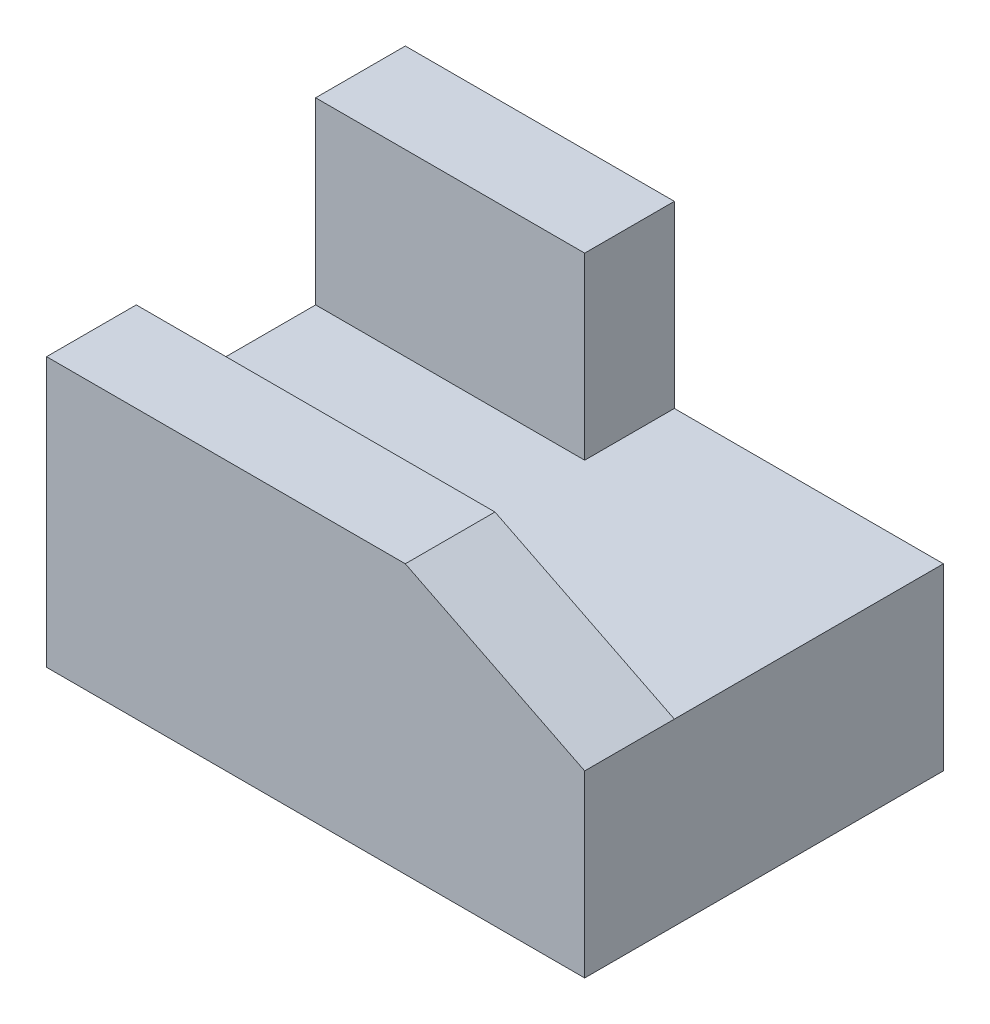
ISO-10303-21;
HEADER;
FILE_DESCRIPTION(('STEP AP214'),'2;1');
FILE_NAME('part.step','',(''),(''),'','','');
FILE_SCHEMA(('AUTOMOTIVE_DESIGN { 1 0 10303 214 1 1 1 1 }'));
ENDSEC;
DATA;
#1=APPLICATION_CONTEXT('core data for automotive mechanical design processes');
#2=APPLICATION_PROTOCOL_DEFINITION('international standard','automotive_design',2000,#1);
#3=PRODUCT_CONTEXT('',#1,'mechanical');
#4=PRODUCT('Part','Part','',(#3));
#5=PRODUCT_RELATED_PRODUCT_CATEGORY('part','',(#4));
#6=PRODUCT_DEFINITION_FORMATION('','',#4);
#7=PRODUCT_DEFINITION_CONTEXT('part definition',#1,'design');
#8=PRODUCT_DEFINITION('design','',#6,#7);
#9=PRODUCT_DEFINITION_SHAPE('','',#8);
#10=(LENGTH_UNIT() NAMED_UNIT(*) SI_UNIT(.MILLI.,.METRE.));
#11=(NAMED_UNIT(*) PLANE_ANGLE_UNIT() SI_UNIT($,.RADIAN.));
#12=(NAMED_UNIT(*) SI_UNIT($,.STERADIAN.) SOLID_ANGLE_UNIT());
#13=UNCERTAINTY_MEASURE_WITH_UNIT(LENGTH_MEASURE(1.E-05),#10,'distance_accuracy_value','');
#14=(GEOMETRIC_REPRESENTATION_CONTEXT(3) GLOBAL_UNCERTAINTY_ASSIGNED_CONTEXT((#13)) GLOBAL_UNIT_ASSIGNED_CONTEXT((#10,
#11,#12)) REPRESENTATION_CONTEXT('',''));
#15=CARTESIAN_POINT('',(0.,0.,0.));
#16=DIRECTION('',(0.,0.,1.));
#17=DIRECTION('',(1.,0.,0.));
#18=AXIS2_PLACEMENT_3D('',#15,#16,#17);
#19=CARTESIAN_POINT('',(-0.768361581920906,7.31073446327684,1.89830508474576));
#20=DIRECTION('',(0.,0.,1.));
#21=DIRECTION('',(1.,0.,0.));
#22=AXIS2_PLACEMENT_3D('',#19,#20,#21);
#23=PLANE('',#22);
#24=DIRECTION('',(0.894427190999916,-0.447213595499958,0.));
#25=VECTOR('',#24,1.);
#26=CARTESIAN_POINT('',(0.231638418079094,8.31073446327684,1.89830508474576));
#27=LINE('',#26,#25);
#28=CARTESIAN_POINT('',(0.231638418079094,8.31073446327684,1.89830508474576));
#29=VERTEX_POINT('',#28);
#30=CARTESIAN_POINT('',(2.23163841807909,7.31073446327684,1.89830508474576));
#31=VERTEX_POINT('',#30);
#32=EDGE_CURVE('E110',#29,#31,#27,.T.);
#33=ORIENTED_EDGE('',*,*,#32,.F.);
#34=DIRECTION('',(-1.,0.,0.));
#35=VECTOR('',#34,1.);
#36=CARTESIAN_POINT('',(-0.768361581920906,8.31073446327684,1.89830508474576));
#37=LINE('',#36,#35);
#38=CARTESIAN_POINT('',(-3.76836158192091,8.31073446327684,1.89830508474576));
#39=VERTEX_POINT('',#38);
#40=EDGE_CURVE('E119',#29,#39,#37,.T.);
#41=ORIENTED_EDGE('',*,*,#40,.T.);
#42=DIRECTION('',(0.,-1.,0.));
#43=VECTOR('',#42,1.);
#44=CARTESIAN_POINT('',(-3.76836158192091,7.31073446327684,1.89830508474576));
#45=LINE('',#44,#43);
#46=CARTESIAN_POINT('',(-3.76836158192091,5.31073446327684,1.89830508474576));
#47=VERTEX_POINT('',#46);
#48=EDGE_CURVE('E153',#39,#47,#45,.T.);
#49=ORIENTED_EDGE('',*,*,#48,.T.);
#50=DIRECTION('',(-1.,0.,0.));
#51=VECTOR('',#50,1.);
#52=CARTESIAN_POINT('',(-0.768361581920906,5.31073446327684,1.89830508474576));
#53=LINE('',#52,#51);
#54=CARTESIAN_POINT('',(2.23163841807909,5.31073446327684,1.89830508474576));
#55=VERTEX_POINT('',#54);
#56=EDGE_CURVE('E143',#55,#47,#53,.T.);
#57=ORIENTED_EDGE('',*,*,#56,.F.);
#58=DIRECTION('',(0.,-1.,0.));
#59=VECTOR('',#58,1.);
#60=CARTESIAN_POINT('',(2.23163841807909,7.31073446327684,1.89830508474576));
#61=LINE('',#60,#59);
#62=EDGE_CURVE('E45',#31,#55,#61,.T.);
#63=ORIENTED_EDGE('',*,*,#62,.F.);
#64=EDGE_LOOP('',(#33,#41,#49,#57,#63));
#65=FACE_BOUND('',#64,.T.);
#66=ADVANCED_FACE('F38',(#65),#23,.T.);
#67=CARTESIAN_POINT('',(2.23163841807909,7.31073446327684,-0.10169491525424));
#68=DIRECTION('',(1.,0.,0.));
#69=DIRECTION('',(0.,0.,-1.));
#70=AXIS2_PLACEMENT_3D('',#67,#68,#69);
#71=PLANE('',#70);
#72=DIRECTION('',(0.,0.,1.));
#73=VECTOR('',#72,1.);
#74=CARTESIAN_POINT('',(2.23163841807909,7.31073446327684,-2.10169491525424));
#75=LINE('',#74,#73);
#76=CARTESIAN_POINT('',(2.23163841807909,7.31073446327684,0.898305084745761));
#77=VERTEX_POINT('',#76);
#78=EDGE_CURVE('E122',#77,#31,#75,.T.);
#79=ORIENTED_EDGE('',*,*,#78,.T.);
#80=ORIENTED_EDGE('',*,*,#62,.T.);
#81=DIRECTION('',(0.,0.,1.));
#82=VECTOR('',#81,1.);
#83=CARTESIAN_POINT('',(2.23163841807909,5.31073446327684,-0.10169491525424));
#84=LINE('',#83,#82);
#85=CARTESIAN_POINT('',(2.23163841807909,5.31073446327684,-2.10169491525424));
#86=VERTEX_POINT('',#85);
#87=EDGE_CURVE('E156',#86,#55,#84,.T.);
#88=ORIENTED_EDGE('',*,*,#87,.F.);
#89=DIRECTION('',(0.,-1.,0.));
#90=VECTOR('',#89,1.);
#91=CARTESIAN_POINT('',(2.23163841807909,7.31073446327684,-2.10169491525424));
#92=LINE('',#91,#90);
#93=CARTESIAN_POINT('',(2.23163841807909,7.31073446327684,-2.10169491525424));
#94=VERTEX_POINT('',#93);
#95=EDGE_CURVE('E166',#94,#86,#92,.T.);
#96=ORIENTED_EDGE('',*,*,#95,.F.);
#97=DIRECTION('',(0.,0.,1.));
#98=VECTOR('',#97,1.);
#99=CARTESIAN_POINT('',(2.23163841807909,7.31073446327684,-0.10169491525424));
#100=LINE('',#99,#98);
#101=EDGE_CURVE('E144',#94,#77,#100,.T.);
#102=ORIENTED_EDGE('',*,*,#101,.T.);
#103=EDGE_LOOP('',(#79,#80,#88,#96,#102));
#104=FACE_BOUND('',#103,.T.);
#105=ADVANCED_FACE('F169',(#104),#71,.T.);
#106=CARTESIAN_POINT('',(-0.768361581920906,7.31073446327684,-2.10169491525424));
#107=DIRECTION('',(0.,0.,1.));
#108=DIRECTION('',(1.,0.,0.));
#109=AXIS2_PLACEMENT_3D('',#106,#107,#108);
#110=PLANE('',#109);
#111=DIRECTION('',(-1.,0.,0.));
#112=VECTOR('',#111,1.);
#113=CARTESIAN_POINT('',(-0.768361581920906,5.31073446327684,-2.10169491525424));
#114=LINE('',#113,#112);
#115=CARTESIAN_POINT('',(-3.76836158192091,5.31073446327684,-2.10169491525424));
#116=VERTEX_POINT('',#115);
#117=EDGE_CURVE('E159',#86,#116,#114,.T.);
#118=ORIENTED_EDGE('',*,*,#117,.T.);
#119=DIRECTION('',(0.,-1.,0.));
#120=VECTOR('',#119,1.);
#121=CARTESIAN_POINT('',(-3.76836158192091,7.31073446327684,-2.10169491525424));
#122=LINE('',#121,#120);
#123=CARTESIAN_POINT('',(-3.76836158192091,9.31073446327684,-2.10169491525424));
#124=VERTEX_POINT('',#123);
#125=EDGE_CURVE('E163',#124,#116,#122,.T.);
#126=ORIENTED_EDGE('',*,*,#125,.F.);
#127=DIRECTION('',(-1.,0.,0.));
#128=VECTOR('',#127,1.);
#129=CARTESIAN_POINT('',(-0.768361581920906,9.31073446327684,-2.10169491525424));
#130=LINE('',#129,#128);
#131=CARTESIAN_POINT('',(-0.768361581920907,9.31073446327684,-2.10169491525424));
#132=VERTEX_POINT('',#131);
#133=EDGE_CURVE('E183',#132,#124,#130,.T.);
#134=ORIENTED_EDGE('',*,*,#133,.F.);
#135=DIRECTION('',(0.,-1.,0.));
#136=VECTOR('',#135,1.);
#137=CARTESIAN_POINT('',(-0.768361581920907,9.31073446327684,-2.10169491525424));
#138=LINE('',#137,#136);
#139=CARTESIAN_POINT('',(-0.768361581920907,7.31073446327684,-2.10169491525424));
#140=VERTEX_POINT('',#139);
#141=EDGE_CURVE('E200',#132,#140,#138,.T.);
#142=ORIENTED_EDGE('',*,*,#141,.T.);
#143=DIRECTION('',(-1.,0.,0.));
#144=VECTOR('',#143,1.);
#145=CARTESIAN_POINT('',(-0.768361581920906,7.31073446327684,-2.10169491525424));
#146=LINE('',#145,#144);
#147=EDGE_CURVE('E147',#94,#140,#146,.T.);
#148=ORIENTED_EDGE('',*,*,#147,.F.);
#149=ORIENTED_EDGE('',*,*,#95,.T.);
#150=EDGE_LOOP('',(#118,#126,#134,#142,#148,#149));
#151=FACE_BOUND('',#150,.T.);
#152=ADVANCED_FACE('F181',(#151),#110,.F.);
#153=CARTESIAN_POINT('',(-3.76836158192091,7.31073446327684,-0.101694915254238));
#154=DIRECTION('',(1.,0.,0.));
#155=DIRECTION('',(0.,0.,-1.));
#156=AXIS2_PLACEMENT_3D('',#153,#154,#155);
#157=PLANE('',#156);
#158=DIRECTION('',(0.,0.,1.));
#159=VECTOR('',#158,1.);
#160=CARTESIAN_POINT('',(-3.76836158192091,5.31073446327684,-0.101694915254238));
#161=LINE('',#160,#159);
#162=EDGE_CURVE('E148',#116,#47,#161,.T.);
#163=ORIENTED_EDGE('',*,*,#162,.T.);
#164=ORIENTED_EDGE('',*,*,#48,.F.);
#165=DIRECTION('',(0.,0.,1.));
#166=VECTOR('',#165,1.);
#167=CARTESIAN_POINT('',(-3.76836158192091,8.31073446327684,-0.101694915254238));
#168=LINE('',#167,#166);
#169=CARTESIAN_POINT('',(-3.76836158192091,8.31073446327684,0.898305084745761));
#170=VERTEX_POINT('',#169);
#171=EDGE_CURVE('E127',#170,#39,#168,.T.);
#172=ORIENTED_EDGE('',*,*,#171,.F.);
#173=DIRECTION('',(0.,-1.,0.));
#174=VECTOR('',#173,1.);
#175=CARTESIAN_POINT('',(-3.76836158192091,8.31073446327684,0.898305084745761));
#176=LINE('',#175,#174);
#177=CARTESIAN_POINT('',(-3.76836158192091,7.31073446327684,0.898305084745761));
#178=VERTEX_POINT('',#177);
#179=EDGE_CURVE('E137',#170,#178,#176,.T.);
#180=ORIENTED_EDGE('',*,*,#179,.T.);
#181=DIRECTION('',(0.,0.,1.));
#182=VECTOR('',#181,1.);
#183=CARTESIAN_POINT('',(-3.76836158192091,7.31073446327684,-0.101694915254238));
#184=LINE('',#183,#182);
#185=CARTESIAN_POINT('',(-3.76836158192091,7.31073446327684,-1.10169491525424));
#186=VERTEX_POINT('',#185);
#187=EDGE_CURVE('E151',#186,#178,#184,.T.);
#188=ORIENTED_EDGE('',*,*,#187,.F.);
#189=DIRECTION('',(0.,-1.,0.));
#190=VECTOR('',#189,1.);
#191=CARTESIAN_POINT('',(-3.76836158192091,9.31073446327684,-1.10169491525424));
#192=LINE('',#191,#190);
#193=CARTESIAN_POINT('',(-3.76836158192091,9.31073446327684,-1.10169491525424));
#194=VERTEX_POINT('',#193);
#195=EDGE_CURVE('E59',#194,#186,#192,.T.);
#196=ORIENTED_EDGE('',*,*,#195,.F.);
#197=DIRECTION('',(0.,0.,1.));
#198=VECTOR('',#197,1.);
#199=CARTESIAN_POINT('',(-3.76836158192091,9.31073446327684,-0.101694915254238));
#200=LINE('',#199,#198);
#201=EDGE_CURVE('E177',#124,#194,#200,.T.);
#202=ORIENTED_EDGE('',*,*,#201,.F.);
#203=ORIENTED_EDGE('',*,*,#125,.T.);
#204=EDGE_LOOP('',(#163,#164,#172,#180,#188,#196,#202,#203));
#205=FACE_BOUND('',#204,.T.);
#206=ADVANCED_FACE('F175',(#205),#157,.F.);
#207=CARTESIAN_POINT('',(-0.768361581920906,7.31073446327684,-0.101694915254239));
#208=DIRECTION('',(0.,1.,0.));
#209=DIRECTION('',(0.,0.,1.));
#210=AXIS2_PLACEMENT_3D('',#207,#208,#209);
#211=PLANE('',#210);
#212=DIRECTION('',(0.,0.,-1.));
#213=VECTOR('',#212,1.);
#214=CARTESIAN_POINT('',(-0.768361581920907,7.31073446327684,-0.101694915254239));
#215=LINE('',#214,#213);
#216=CARTESIAN_POINT('',(-0.768361581920907,7.31073446327684,-1.10169491525424));
#217=VERTEX_POINT('',#216);
#218=EDGE_CURVE('E129',#217,#140,#215,.T.);
#219=ORIENTED_EDGE('',*,*,#218,.F.);
#220=DIRECTION('',(-1.,0.,0.));
#221=VECTOR('',#220,1.);
#222=CARTESIAN_POINT('',(-0.768361581920906,7.31073446327684,-1.10169491525424));
#223=LINE('',#222,#221);
#224=EDGE_CURVE('E132',#217,#186,#223,.T.);
#225=ORIENTED_EDGE('',*,*,#224,.T.);
#226=ORIENTED_EDGE('',*,*,#187,.T.);
#227=DIRECTION('',(-1.,0.,0.));
#228=VECTOR('',#227,1.);
#229=CARTESIAN_POINT('',(-0.768361581920906,7.31073446327684,0.898305084745761));
#230=LINE('',#229,#228);
#231=EDGE_CURVE('E140',#77,#178,#230,.T.);
#232=ORIENTED_EDGE('',*,*,#231,.F.);
#233=ORIENTED_EDGE('',*,*,#101,.F.);
#234=ORIENTED_EDGE('',*,*,#147,.T.);
#235=EDGE_LOOP('',(#219,#225,#226,#232,#233,#234));
#236=FACE_BOUND('',#235,.T.);
#237=ADVANCED_FACE('F204',(#236),#211,.T.);
#238=CARTESIAN_POINT('',(-0.768361581920906,5.31073446327684,-0.101694915254239));
#239=DIRECTION('',(0.,1.,0.));
#240=DIRECTION('',(0.,0.,1.));
#241=AXIS2_PLACEMENT_3D('',#238,#239,#240);
#242=PLANE('',#241);
#243=ORIENTED_EDGE('',*,*,#162,.F.);
#244=ORIENTED_EDGE('',*,*,#117,.F.);
#245=ORIENTED_EDGE('',*,*,#87,.T.);
#246=ORIENTED_EDGE('',*,*,#56,.T.);
#247=EDGE_LOOP('',(#243,#244,#245,#246));
#248=FACE_BOUND('',#247,.T.);
#249=ADVANCED_FACE('F173',(#248),#242,.F.);
#250=CARTESIAN_POINT('',(-0.768361581920906,8.31073446327684,0.898305084745761));
#251=DIRECTION('',(0.,0.,-1.));
#252=DIRECTION('',(-1.,0.,0.));
#253=AXIS2_PLACEMENT_3D('',#250,#251,#252);
#254=PLANE('',#253);
#255=DIRECTION('',(-0.894427190999916,0.447213595499958,0.));
#256=VECTOR('',#255,1.);
#257=CARTESIAN_POINT('',(-0.568361581920906,8.71073446327684,0.898305084745761));
#258=LINE('',#257,#256);
#259=CARTESIAN_POINT('',(0.231638418079094,8.31073446327684,0.898305084745761));
#260=VERTEX_POINT('',#259);
#261=EDGE_CURVE('E51',#77,#260,#258,.T.);
#262=ORIENTED_EDGE('',*,*,#261,.F.);
#263=ORIENTED_EDGE('',*,*,#231,.T.);
#264=ORIENTED_EDGE('',*,*,#179,.F.);
#265=DIRECTION('',(1.,0.,0.));
#266=VECTOR('',#265,1.);
#267=CARTESIAN_POINT('',(-0.768361581920906,8.31073446327684,0.898305084745761));
#268=LINE('',#267,#266);
#269=EDGE_CURVE('E128',#170,#260,#268,.T.);
#270=ORIENTED_EDGE('',*,*,#269,.T.);
#271=EDGE_LOOP('',(#262,#263,#264,#270));
#272=FACE_BOUND('',#271,.T.);
#273=ADVANCED_FACE('F208',(#272),#254,.T.);
#274=CARTESIAN_POINT('',(-0.768361581920906,8.31073446327684,-0.101694915254239));
#275=DIRECTION('',(0.,1.,0.));
#276=DIRECTION('',(0.,0.,1.));
#277=AXIS2_PLACEMENT_3D('',#274,#275,#276);
#278=PLANE('',#277);
#279=DIRECTION('',(0.,0.,1.));
#280=VECTOR('',#279,1.);
#281=CARTESIAN_POINT('',(0.231638418079094,8.31073446327684,-0.101694915254239));
#282=LINE('',#281,#280);
#283=EDGE_CURVE('E11',#260,#29,#282,.T.);
#284=ORIENTED_EDGE('',*,*,#283,.F.);
#285=ORIENTED_EDGE('',*,*,#269,.F.);
#286=ORIENTED_EDGE('',*,*,#171,.T.);
#287=ORIENTED_EDGE('',*,*,#40,.F.);
#288=EDGE_LOOP('',(#284,#285,#286,#287));
#289=FACE_BOUND('',#288,.T.);
#290=ADVANCED_FACE('F125',(#289),#278,.T.);
#291=CARTESIAN_POINT('',(-0.768361581920907,9.31073446327684,-0.101694915254239));
#292=DIRECTION('',(1.,0.,0.));
#293=DIRECTION('',(0.,0.,-1.));
#294=AXIS2_PLACEMENT_3D('',#291,#292,#293);
#295=PLANE('',#294);
#296=DIRECTION('',(0.,-1.,0.));
#297=VECTOR('',#296,1.);
#298=CARTESIAN_POINT('',(-0.768361581920907,9.31073446327684,-1.10169491525424));
#299=LINE('',#298,#297);
#300=CARTESIAN_POINT('',(-0.768361581920907,9.31073446327684,-1.10169491525424));
#301=VERTEX_POINT('',#300);
#302=EDGE_CURVE('E196',#301,#217,#299,.T.);
#303=ORIENTED_EDGE('',*,*,#302,.T.);
#304=ORIENTED_EDGE('',*,*,#218,.T.);
#305=ORIENTED_EDGE('',*,*,#141,.F.);
#306=DIRECTION('',(0.,0.,1.));
#307=VECTOR('',#306,1.);
#308=CARTESIAN_POINT('',(-0.768361581920907,9.31073446327684,-0.101694915254239));
#309=LINE('',#308,#307);
#310=EDGE_CURVE('E188',#132,#301,#309,.T.);
#311=ORIENTED_EDGE('',*,*,#310,.T.);
#312=EDGE_LOOP('',(#303,#304,#305,#311));
#313=FACE_BOUND('',#312,.T.);
#314=ADVANCED_FACE('F212',(#313),#295,.T.);
#315=CARTESIAN_POINT('',(-0.768361581920906,9.31073446327684,-1.10169491525424));
#316=DIRECTION('',(0.,0.,-1.));
#317=DIRECTION('',(-1.,0.,0.));
#318=AXIS2_PLACEMENT_3D('',#315,#316,#317);
#319=PLANE('',#318);
#320=ORIENTED_EDGE('',*,*,#224,.F.);
#321=ORIENTED_EDGE('',*,*,#302,.F.);
#322=DIRECTION('',(1.,0.,0.));
#323=VECTOR('',#322,1.);
#324=CARTESIAN_POINT('',(-0.768361581920906,9.31073446327684,-1.10169491525424));
#325=LINE('',#324,#323);
#326=EDGE_CURVE('E190',#194,#301,#325,.T.);
#327=ORIENTED_EDGE('',*,*,#326,.F.);
#328=ORIENTED_EDGE('',*,*,#195,.T.);
#329=EDGE_LOOP('',(#320,#321,#327,#328));
#330=FACE_BOUND('',#329,.T.);
#331=ADVANCED_FACE('F213',(#330),#319,.F.);
#332=CARTESIAN_POINT('',(-0.768361581920906,9.31073446327684,-0.101694915254239));
#333=DIRECTION('',(0.,1.,0.));
#334=DIRECTION('',(0.,0.,1.));
#335=AXIS2_PLACEMENT_3D('',#332,#333,#334);
#336=PLANE('',#335);
#337=ORIENTED_EDGE('',*,*,#310,.F.);
#338=ORIENTED_EDGE('',*,*,#133,.T.);
#339=ORIENTED_EDGE('',*,*,#201,.T.);
#340=ORIENTED_EDGE('',*,*,#326,.T.);
#341=EDGE_LOOP('',(#337,#338,#339,#340));
#342=FACE_BOUND('',#341,.T.);
#343=ADVANCED_FACE('F186',(#342),#336,.T.);
#344=CARTESIAN_POINT('',(0.231638418079094,8.31073446327684,-2.10169491525424));
#345=DIRECTION('',(-0.447213595499958,-0.894427190999916,0.));
#346=DIRECTION('',(0.894427190999916,-0.447213595499958,0.));
#347=AXIS2_PLACEMENT_3D('',#344,#345,#346);
#348=PLANE('',#347);
#349=ORIENTED_EDGE('',*,*,#261,.T.);
#350=ORIENTED_EDGE('',*,*,#283,.T.);
#351=ORIENTED_EDGE('',*,*,#32,.T.);
#352=ORIENTED_EDGE('',*,*,#78,.F.);
#353=EDGE_LOOP('',(#349,#350,#351,#352));
#354=FACE_BOUND('',#353,.T.);
#355=ADVANCED_FACE('F109',(#354),#348,.F.);
#356=CLOSED_SHELL('',(#66,#105,#152,#206,#237,#249,#273,#290,#314,#331,#343,#355));
#357=MANIFOLD_SOLID_BREP('B2',#356);
#358=ADVANCED_BREP_SHAPE_REPRESENTATION('',(#18,#357),#14);
#359=SHAPE_DEFINITION_REPRESENTATION(#9,#358);
ENDSEC;
END-ISO-10303-21;
